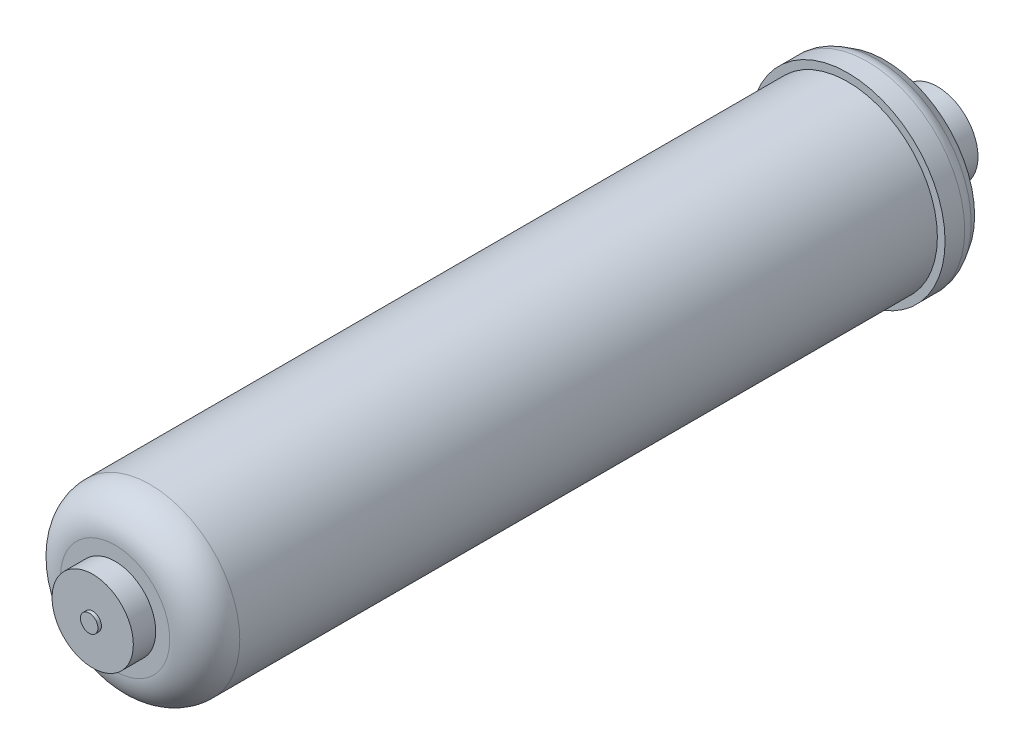
ISO-10303-21;
HEADER;
FILE_DESCRIPTION(('STEP AP214'),'2;1');
FILE_NAME('part.step','',(''),(''),'','','');
FILE_SCHEMA(('AUTOMOTIVE_DESIGN { 1 0 10303 214 1 1 1 1 }'));
ENDSEC;
DATA;
#1=APPLICATION_CONTEXT('core data for automotive mechanical design processes');
#2=APPLICATION_PROTOCOL_DEFINITION('international standard','automotive_design',2000,#1);
#3=PRODUCT_CONTEXT('',#1,'mechanical');
#4=PRODUCT('Part','Part','',(#3));
#5=PRODUCT_RELATED_PRODUCT_CATEGORY('part','',(#4));
#6=PRODUCT_DEFINITION_FORMATION('','',#4);
#7=PRODUCT_DEFINITION_CONTEXT('part definition',#1,'design');
#8=PRODUCT_DEFINITION('design','',#6,#7);
#9=PRODUCT_DEFINITION_SHAPE('','',#8);
#10=(LENGTH_UNIT() NAMED_UNIT(*) SI_UNIT(.MILLI.,.METRE.));
#11=(NAMED_UNIT(*) PLANE_ANGLE_UNIT() SI_UNIT($,.RADIAN.));
#12=(NAMED_UNIT(*) SI_UNIT($,.STERADIAN.) SOLID_ANGLE_UNIT());
#13=UNCERTAINTY_MEASURE_WITH_UNIT(LENGTH_MEASURE(1.E-05),#10,'distance_accuracy_value','');
#14=(GEOMETRIC_REPRESENTATION_CONTEXT(3) GLOBAL_UNCERTAINTY_ASSIGNED_CONTEXT((#13)) GLOBAL_UNIT_ASSIGNED_CONTEXT((#10,
#11,#12)) REPRESENTATION_CONTEXT('',''));
#15=CARTESIAN_POINT('',(0.,0.,0.));
#16=DIRECTION('',(0.,0.,1.));
#17=DIRECTION('',(1.,0.,0.));
#18=AXIS2_PLACEMENT_3D('',#15,#16,#17);
#19=CARTESIAN_POINT('',(0.,0.,0.));
#20=DIRECTION('',(0.,0.,-1.));
#21=DIRECTION('',(-1.,0.,0.));
#22=AXIS2_PLACEMENT_3D('',#19,#20,#21);
#23=PLANE('',#22);
#24=CARTESIAN_POINT('',(0.,0.,0.));
#25=DIRECTION('',(0.,0.,1.));
#26=DIRECTION('',(1.,0.,0.));
#27=AXIS2_PLACEMENT_3D('',#24,#25,#26);
#28=CIRCLE('',#27,3.175);
#29=CARTESIAN_POINT('',(3.175,0.,0.));
#30=VERTEX_POINT('',#29);
#31=EDGE_CURVE('E50',#30,#30,#28,.T.);
#32=ORIENTED_EDGE('',*,*,#31,.T.);
#33=EDGE_LOOP('',(#32));
#34=FACE_BOUND('',#33,.T.);
#35=ADVANCED_FACE('F30',(#34),#23,.F.);
#36=CARTESIAN_POINT('',(0.,0.,0.));
#37=DIRECTION('',(0.,0.,1.));
#38=DIRECTION('',(1.,0.,0.));
#39=AXIS2_PLACEMENT_3D('',#36,#37,#38);
#40=CYLINDRICAL_SURFACE('',#39,3.175);
#41=ORIENTED_EDGE('',*,*,#31,.F.);
#42=EDGE_LOOP('',(#41));
#43=FACE_BOUND('',#42,.T.);
#44=CARTESIAN_POINT('',(0.,0.,-1.27));
#45=DIRECTION('',(0.,0.,1.));
#46=DIRECTION('',(1.,0.,0.));
#47=AXIS2_PLACEMENT_3D('',#44,#45,#46);
#48=CIRCLE('',#47,3.175);
#49=CARTESIAN_POINT('',(3.175,0.,-1.27));
#50=VERTEX_POINT('',#49);
#51=EDGE_CURVE('E53',#50,#50,#48,.T.);
#52=ORIENTED_EDGE('',*,*,#51,.T.);
#53=EDGE_LOOP('',(#52));
#54=FACE_BOUND('',#53,.T.);
#55=ADVANCED_FACE('F99',(#43,#54),#40,.T.);
#56=CARTESIAN_POINT('',(0.,3.175,-1.27));
#57=DIRECTION('',(0.,0.,-1.));
#58=DIRECTION('',(-1.,0.,0.));
#59=AXIS2_PLACEMENT_3D('',#56,#57,#58);
#60=PLANE('',#59);
#61=ORIENTED_EDGE('',*,*,#51,.F.);
#62=EDGE_LOOP('',(#61));
#63=FACE_BOUND('',#62,.T.);
#64=CARTESIAN_POINT('',(0.,0.,-1.27));
#65=DIRECTION('',(0.,0.,1.));
#66=DIRECTION('',(1.,0.,0.));
#67=AXIS2_PLACEMENT_3D('',#64,#65,#66);
#68=CIRCLE('',#67,14.732);
#69=CARTESIAN_POINT('',(14.732,0.,-1.27));
#70=VERTEX_POINT('',#69);
#71=EDGE_CURVE('E56',#70,#70,#68,.T.);
#72=ORIENTED_EDGE('',*,*,#71,.T.);
#73=EDGE_LOOP('',(#72));
#74=FACE_BOUND('',#73,.T.);
#75=ADVANCED_FACE('F105',(#63,#74),#60,.F.);
#76=CARTESIAN_POINT('',(0.,0.,0.));
#77=DIRECTION('',(0.,0.,1.));
#78=DIRECTION('',(1.,0.,0.));
#79=AXIS2_PLACEMENT_3D('',#76,#77,#78);
#80=CYLINDRICAL_SURFACE('',#79,14.732);
#81=ORIENTED_EDGE('',*,*,#71,.F.);
#82=EDGE_LOOP('',(#81));
#83=FACE_BOUND('',#82,.T.);
#84=CARTESIAN_POINT('',(0.,0.,-9.398));
#85=DIRECTION('',(0.,0.,1.));
#86=DIRECTION('',(1.,0.,0.));
#87=AXIS2_PLACEMENT_3D('',#84,#85,#86);
#88=CIRCLE('',#87,14.732);
#89=CARTESIAN_POINT('',(14.732,0.,-9.398));
#90=VERTEX_POINT('',#89);
#91=EDGE_CURVE('E59',#90,#90,#88,.T.);
#92=ORIENTED_EDGE('',*,*,#91,.T.);
#93=EDGE_LOOP('',(#92));
#94=FACE_BOUND('',#93,.T.);
#95=ADVANCED_FACE('F111',(#83,#94),#80,.T.);
#96=CARTESIAN_POINT('',(0.,14.732,-9.398));
#97=DIRECTION('',(0.,0.,-1.));
#98=DIRECTION('',(-1.,0.,0.));
#99=AXIS2_PLACEMENT_3D('',#96,#97,#98);
#100=PLANE('',#99);
#101=CARTESIAN_POINT('',(0.,0.,-9.398));
#102=DIRECTION('',(0.,0.,-1.));
#103=DIRECTION('',(-1.,0.,0.));
#104=AXIS2_PLACEMENT_3D('',#101,#102,#103);
#105=CIRCLE('',#104,19.812);
#106=CARTESIAN_POINT('',(-19.812,0.,-9.398));
#107=VERTEX_POINT('',#106);
#108=EDGE_CURVE('E45',#107,#107,#105,.F.);
#109=ORIENTED_EDGE('',*,*,#108,.T.);
#110=EDGE_LOOP('',(#109));
#111=FACE_BOUND('',#110,.T.);
#112=ORIENTED_EDGE('',*,*,#91,.F.);
#113=EDGE_LOOP('',(#112));
#114=FACE_BOUND('',#113,.T.);
#115=ADVANCED_FACE('F115',(#111,#114),#100,.F.);
#116=CARTESIAN_POINT('',(0.,0.,0.));
#117=DIRECTION('',(0.,0.,1.));
#118=DIRECTION('',(1.,0.,0.));
#119=AXIS2_PLACEMENT_3D('',#116,#117,#118);
#120=CYLINDRICAL_SURFACE('',#119,32.512);
#121=CARTESIAN_POINT('',(0.,0.,-22.098));
#122=DIRECTION('',(0.,0.,-1.));
#123=DIRECTION('',(-1.,0.,0.));
#124=AXIS2_PLACEMENT_3D('',#121,#122,#123);
#125=CIRCLE('',#124,32.512);
#126=CARTESIAN_POINT('',(-32.512,0.,-22.098));
#127=VERTEX_POINT('',#126);
#128=EDGE_CURVE('E41',#127,#127,#125,.T.);
#129=ORIENTED_EDGE('',*,*,#128,.T.);
#130=EDGE_LOOP('',(#129));
#131=FACE_BOUND('',#130,.T.);
#132=CARTESIAN_POINT('',(0.,0.,-275.082));
#133=DIRECTION('',(0.,0.,1.));
#134=DIRECTION('',(1.,0.,0.));
#135=AXIS2_PLACEMENT_3D('',#132,#133,#134);
#136=CIRCLE('',#135,32.512);
#137=CARTESIAN_POINT('',(32.512,0.,-275.082));
#138=VERTEX_POINT('',#137);
#139=EDGE_CURVE('E62',#138,#138,#136,.T.);
#140=ORIENTED_EDGE('',*,*,#139,.T.);
#141=EDGE_LOOP('',(#140));
#142=FACE_BOUND('',#141,.T.);
#143=ADVANCED_FACE('F119',(#131,#142),#120,.T.);
#144=CARTESIAN_POINT('',(0.,32.512,-275.082));
#145=DIRECTION('',(0.,0.,-1.));
#146=DIRECTION('',(-1.,0.,0.));
#147=AXIS2_PLACEMENT_3D('',#144,#145,#146);
#148=PLANE('',#147);
#149=ORIENTED_EDGE('',*,*,#139,.F.);
#150=EDGE_LOOP('',(#149));
#151=FACE_BOUND('',#150,.T.);
#152=CARTESIAN_POINT('',(0.,0.,-275.082));
#153=DIRECTION('',(0.,0.,1.));
#154=DIRECTION('',(1.,0.,0.));
#155=AXIS2_PLACEMENT_3D('',#152,#153,#154);
#156=CIRCLE('',#155,35.306);
#157=CARTESIAN_POINT('',(35.306,0.,-275.082));
#158=VERTEX_POINT('',#157);
#159=EDGE_CURVE('E65',#158,#158,#156,.T.);
#160=ORIENTED_EDGE('',*,*,#159,.T.);
#161=EDGE_LOOP('',(#160));
#162=FACE_BOUND('',#161,.T.);
#163=ADVANCED_FACE('F123',(#151,#162),#148,.F.);
#164=CARTESIAN_POINT('',(0.,0.,0.));
#165=DIRECTION('',(0.,0.,1.));
#166=DIRECTION('',(1.,0.,0.));
#167=AXIS2_PLACEMENT_3D('',#164,#165,#166);
#168=CYLINDRICAL_SURFACE('',#167,35.306);
#169=CARTESIAN_POINT('',(0.,0.,-282.2089120975));
#170=DIRECTION('',(0.,0.,-1.));
#171=DIRECTION('',(-1.,0.,0.));
#172=AXIS2_PLACEMENT_3D('',#169,#170,#171);
#173=CIRCLE('',#172,35.306);
#174=CARTESIAN_POINT('',(-35.306,0.,-282.2089120975));
#175=VERTEX_POINT('',#174);
#176=EDGE_CURVE('E37',#175,#175,#173,.F.);
#177=ORIENTED_EDGE('',*,*,#176,.T.);
#178=EDGE_LOOP('',(#177));
#179=FACE_BOUND('',#178,.T.);
#180=ORIENTED_EDGE('',*,*,#159,.F.);
#181=EDGE_LOOP('',(#180));
#182=FACE_BOUND('',#181,.T.);
#183=ADVANCED_FACE('F127',(#179,#182),#168,.T.);
#184=CARTESIAN_POINT('',(0.,0.,-288.544));
#185=DIRECTION('',(0.,0.,1.));
#186=DIRECTION('',(1.,0.,0.));
#187=AXIS2_PLACEMENT_3D('',#184,#185,#186);
#188=CONICAL_SURFACE('',#187,32.5550841268207,0.541659485455934);
#189=CARTESIAN_POINT('',(0.,0.,-285.482709449718));
#190=DIRECTION('',(0.,0.,-1.));
#191=DIRECTION('',(-1.,0.,0.));
#192=AXIS2_PLACEMENT_3D('',#189,#190,#191);
#193=CIRCLE('',#192,34.3970248020577);
#194=CARTESIAN_POINT('',(-34.3970248020577,0.,-285.482709449718));
#195=VERTEX_POINT('',#194);
#196=EDGE_CURVE('E10',#195,#195,#193,.T.);
#197=ORIENTED_EDGE('',*,*,#196,.T.);
#198=EDGE_LOOP('',(#197));
#199=FACE_BOUND('',#198,.T.);
#200=CARTESIAN_POINT('',(0.,0.,-288.544));
#201=DIRECTION('',(0.,0.,1.));
#202=DIRECTION('',(1.,0.,0.));
#203=AXIS2_PLACEMENT_3D('',#200,#201,#202);
#204=CIRCLE('',#203,32.5550841268207);
#205=CARTESIAN_POINT('',(32.5550841268207,0.,-288.544));
#206=VERTEX_POINT('',#205);
#207=EDGE_CURVE('E68',#206,#206,#204,.T.);
#208=ORIENTED_EDGE('',*,*,#207,.T.);
#209=EDGE_LOOP('',(#208));
#210=FACE_BOUND('',#209,.T.);
#211=ADVANCED_FACE('F131',(#199,#210),#188,.T.);
#212=CARTESIAN_POINT('',(0.,0.,-299.466));
#213=DIRECTION('',(0.,0.,1.));
#214=DIRECTION('',(1.,0.,0.));
#215=AXIS2_PLACEMENT_3D('',#212,#213,#214);
#216=CONICAL_SURFACE('',#215,14.732,1.02101761241668);
#217=ORIENTED_EDGE('',*,*,#207,.F.);
#218=EDGE_LOOP('',(#217));
#219=FACE_BOUND('',#218,.T.);
#220=CARTESIAN_POINT('',(0.,0.,-299.466));
#221=DIRECTION('',(0.,0.,1.));
#222=DIRECTION('',(1.,0.,0.));
#223=AXIS2_PLACEMENT_3D('',#220,#221,#222);
#224=CIRCLE('',#223,14.732);
#225=CARTESIAN_POINT('',(14.732,0.,-299.466));
#226=VERTEX_POINT('',#225);
#227=EDGE_CURVE('E71',#226,#226,#224,.T.);
#228=ORIENTED_EDGE('',*,*,#227,.T.);
#229=EDGE_LOOP('',(#228));
#230=FACE_BOUND('',#229,.T.);
#231=ADVANCED_FACE('F134',(#219,#230),#216,.T.);
#232=CARTESIAN_POINT('',(0.,0.,0.));
#233=DIRECTION('',(0.,0.,1.));
#234=DIRECTION('',(1.,0.,0.));
#235=AXIS2_PLACEMENT_3D('',#232,#233,#234);
#236=CYLINDRICAL_SURFACE('',#235,14.732);
#237=ORIENTED_EDGE('',*,*,#227,.F.);
#238=EDGE_LOOP('',(#237));
#239=FACE_BOUND('',#238,.T.);
#240=CARTESIAN_POINT('',(0.,0.,-307.594));
#241=DIRECTION('',(0.,0.,1.));
#242=DIRECTION('',(1.,0.,0.));
#243=AXIS2_PLACEMENT_3D('',#240,#241,#242);
#244=CIRCLE('',#243,14.732);
#245=CARTESIAN_POINT('',(14.732,0.,-307.594));
#246=VERTEX_POINT('',#245);
#247=EDGE_CURVE('E74',#246,#246,#244,.T.);
#248=ORIENTED_EDGE('',*,*,#247,.T.);
#249=EDGE_LOOP('',(#248));
#250=FACE_BOUND('',#249,.T.);
#251=ADVANCED_FACE('F137',(#239,#250),#236,.T.);
#252=CARTESIAN_POINT('',(0.,14.732,-307.594));
#253=DIRECTION('',(0.,0.,1.));
#254=DIRECTION('',(1.,0.,0.));
#255=AXIS2_PLACEMENT_3D('',#252,#253,#254);
#256=PLANE('',#255);
#257=ORIENTED_EDGE('',*,*,#247,.F.);
#258=EDGE_LOOP('',(#257));
#259=FACE_BOUND('',#258,.T.);
#260=CARTESIAN_POINT('',(0.,0.,-307.594));
#261=DIRECTION('',(0.,0.,1.));
#262=DIRECTION('',(1.,0.,0.));
#263=AXIS2_PLACEMENT_3D('',#260,#261,#262);
#264=CIRCLE('',#263,3.175);
#265=CARTESIAN_POINT('',(3.175,0.,-307.594));
#266=VERTEX_POINT('',#265);
#267=EDGE_CURVE('E77',#266,#266,#264,.T.);
#268=ORIENTED_EDGE('',*,*,#267,.T.);
#269=EDGE_LOOP('',(#268));
#270=FACE_BOUND('',#269,.T.);
#271=ADVANCED_FACE('F95',(#259,#270),#256,.F.);
#272=CARTESIAN_POINT('',(0.,0.,0.));
#273=DIRECTION('',(0.,0.,1.));
#274=DIRECTION('',(1.,0.,0.));
#275=AXIS2_PLACEMENT_3D('',#272,#273,#274);
#276=CYLINDRICAL_SURFACE('',#275,3.175);
#277=ORIENTED_EDGE('',*,*,#267,.F.);
#278=EDGE_LOOP('',(#277));
#279=FACE_BOUND('',#278,.T.);
#280=CARTESIAN_POINT('',(0.,0.,-308.864));
#281=DIRECTION('',(0.,0.,1.));
#282=DIRECTION('',(1.,0.,0.));
#283=AXIS2_PLACEMENT_3D('',#280,#281,#282);
#284=CIRCLE('',#283,3.175);
#285=CARTESIAN_POINT('',(3.175,0.,-308.864));
#286=VERTEX_POINT('',#285);
#287=EDGE_CURVE('E80',#286,#286,#284,.T.);
#288=ORIENTED_EDGE('',*,*,#287,.T.);
#289=EDGE_LOOP('',(#288));
#290=FACE_BOUND('',#289,.T.);
#291=ADVANCED_FACE('F84',(#279,#290),#276,.T.);
#292=CARTESIAN_POINT('',(0.,3.175,-308.864));
#293=DIRECTION('',(0.,0.,1.));
#294=DIRECTION('',(1.,0.,0.));
#295=AXIS2_PLACEMENT_3D('',#292,#293,#294);
#296=PLANE('',#295);
#297=ORIENTED_EDGE('',*,*,#287,.F.);
#298=EDGE_LOOP('',(#297));
#299=FACE_BOUND('',#298,.T.);
#300=ADVANCED_FACE('F86',(#299),#296,.F.);
#301=CARTESIAN_POINT('',(0.,0.,-22.098));
#302=DIRECTION('',(0.,0.,-1.));
#303=DIRECTION('',(-1.,0.,0.));
#304=AXIS2_PLACEMENT_3D('',#301,#302,#303);
#305=TOROIDAL_SURFACE('',#304,19.812,12.7);
#306=ORIENTED_EDGE('',*,*,#128,.F.);
#307=EDGE_LOOP('',(#306));
#308=FACE_BOUND('',#307,.T.);
#309=ORIENTED_EDGE('',*,*,#108,.F.);
#310=EDGE_LOOP('',(#309));
#311=FACE_BOUND('',#310,.T.);
#312=ADVANCED_FACE('F88',(#308,#311),#305,.T.);
#313=CARTESIAN_POINT('',(0.,0.,-282.2089120975));
#314=DIRECTION('',(0.,0.,-1.));
#315=DIRECTION('',(-1.,0.,0.));
#316=AXIS2_PLACEMENT_3D('',#313,#314,#315);
#317=TOROIDAL_SURFACE('',#316,28.956,6.35);
#318=ORIENTED_EDGE('',*,*,#196,.F.);
#319=EDGE_LOOP('',(#318));
#320=FACE_BOUND('',#319,.T.);
#321=ORIENTED_EDGE('',*,*,#176,.F.);
#322=EDGE_LOOP('',(#321));
#323=FACE_BOUND('',#322,.T.);
#324=ADVANCED_FACE('F32',(#320,#323),#317,.T.);
#325=CLOSED_SHELL('',(#35,#55,#75,#95,#115,#143,#163,#183,#211,#231,#251,#271,#291,#300,#312,#324));
#326=MANIFOLD_SOLID_BREP('B2',#325);
#327=ADVANCED_BREP_SHAPE_REPRESENTATION('',(#18,#326),#14);
#328=SHAPE_DEFINITION_REPRESENTATION(#9,#327);
ENDSEC;
END-ISO-10303-21;
